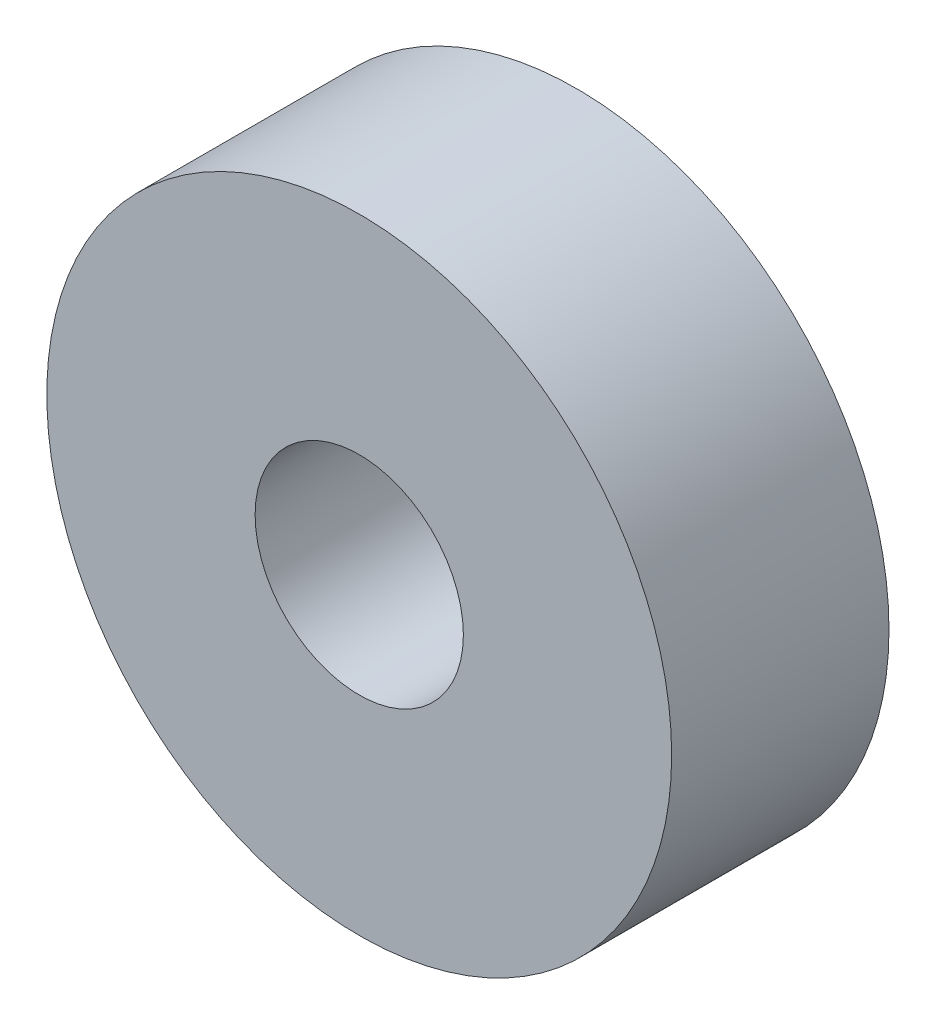
ISO-10303-21;
HEADER;
FILE_DESCRIPTION(('STEP AP214'),'2;1');
FILE_NAME('part.step','',(''),(''),'','','');
FILE_SCHEMA(('AUTOMOTIVE_DESIGN { 1 0 10303 214 1 1 1 1 }'));
ENDSEC;
DATA;
#1=APPLICATION_CONTEXT('core data for automotive mechanical design processes');
#2=APPLICATION_PROTOCOL_DEFINITION('international standard','automotive_design',2000,#1);
#3=PRODUCT_CONTEXT('',#1,'mechanical');
#4=PRODUCT('Part','Part','',(#3));
#5=PRODUCT_RELATED_PRODUCT_CATEGORY('part','',(#4));
#6=PRODUCT_DEFINITION_FORMATION('','',#4);
#7=PRODUCT_DEFINITION_CONTEXT('part definition',#1,'design');
#8=PRODUCT_DEFINITION('design','',#6,#7);
#9=PRODUCT_DEFINITION_SHAPE('','',#8);
#10=(LENGTH_UNIT() NAMED_UNIT(*) SI_UNIT(.MILLI.,.METRE.));
#11=(NAMED_UNIT(*) PLANE_ANGLE_UNIT() SI_UNIT($,.RADIAN.));
#12=(NAMED_UNIT(*) SI_UNIT($,.STERADIAN.) SOLID_ANGLE_UNIT());
#13=UNCERTAINTY_MEASURE_WITH_UNIT(LENGTH_MEASURE(1.E-05),#10,'distance_accuracy_value','');
#14=(GEOMETRIC_REPRESENTATION_CONTEXT(3) GLOBAL_UNCERTAINTY_ASSIGNED_CONTEXT((#13)) GLOBAL_UNIT_ASSIGNED_CONTEXT((#10,
#11,#12)) REPRESENTATION_CONTEXT('',''));
#15=CARTESIAN_POINT('',(0.,0.,0.));
#16=DIRECTION('',(0.,0.,1.));
#17=DIRECTION('',(1.,0.,0.));
#18=AXIS2_PLACEMENT_3D('',#15,#16,#17);
#19=CARTESIAN_POINT('',(0.,0.,3.048));
#20=DIRECTION('',(0.,0.,1.));
#21=DIRECTION('',(1.,0.,0.));
#22=AXIS2_PLACEMENT_3D('',#19,#20,#21);
#23=PLANE('',#22);
#24=CARTESIAN_POINT('',(0.,0.,3.048));
#25=DIRECTION('',(0.,0.,1.));
#26=DIRECTION('',(1.,0.,0.));
#27=AXIS2_PLACEMENT_3D('',#24,#25,#26);
#28=CIRCLE('',#27,4.3815);
#29=CARTESIAN_POINT('',(4.3815,0.,3.048));
#30=VERTEX_POINT('',#29);
#31=EDGE_CURVE('E10',#30,#30,#28,.T.);
#32=ORIENTED_EDGE('',*,*,#31,.T.);
#33=EDGE_LOOP('',(#32));
#34=FACE_BOUND('',#33,.T.);
#35=CARTESIAN_POINT('',(0.,0.,3.048));
#36=DIRECTION('',(0.,0.,1.));
#37=DIRECTION('',(1.,0.,0.));
#38=AXIS2_PLACEMENT_3D('',#35,#36,#37);
#39=CIRCLE('',#38,1.4605);
#40=CARTESIAN_POINT('',(1.4605,0.,3.048));
#41=VERTEX_POINT('',#40);
#42=EDGE_CURVE('E41',#41,#41,#39,.T.);
#43=ORIENTED_EDGE('',*,*,#42,.F.);
#44=EDGE_LOOP('',(#43));
#45=FACE_BOUND('',#44,.T.);
#46=ADVANCED_FACE('F30',(#34,#45),#23,.T.);
#47=CARTESIAN_POINT('',(0.,0.,0.));
#48=DIRECTION('',(0.,0.,1.));
#49=DIRECTION('',(1.,0.,0.));
#50=AXIS2_PLACEMENT_3D('',#47,#48,#49);
#51=PLANE('',#50);
#52=CARTESIAN_POINT('',(0.,0.,0.));
#53=DIRECTION('',(0.,0.,1.));
#54=DIRECTION('',(1.,0.,0.));
#55=AXIS2_PLACEMENT_3D('',#52,#53,#54);
#56=CIRCLE('',#55,4.3815);
#57=CARTESIAN_POINT('',(4.3815,0.,0.));
#58=VERTEX_POINT('',#57);
#59=EDGE_CURVE('E34',#58,#58,#56,.T.);
#60=ORIENTED_EDGE('',*,*,#59,.F.);
#61=EDGE_LOOP('',(#60));
#62=FACE_BOUND('',#61,.T.);
#63=CARTESIAN_POINT('',(0.,0.,0.));
#64=DIRECTION('',(0.,0.,1.));
#65=DIRECTION('',(1.,0.,0.));
#66=AXIS2_PLACEMENT_3D('',#63,#64,#65);
#67=CIRCLE('',#66,1.4605);
#68=CARTESIAN_POINT('',(1.4605,0.,0.));
#69=VERTEX_POINT('',#68);
#70=EDGE_CURVE('E43',#69,#69,#67,.T.);
#71=ORIENTED_EDGE('',*,*,#70,.T.);
#72=EDGE_LOOP('',(#71));
#73=FACE_BOUND('',#72,.T.);
#74=ADVANCED_FACE('F53',(#62,#73),#51,.F.);
#75=CARTESIAN_POINT('',(0.,0.,3.048));
#76=DIRECTION('',(0.,0.,-1.));
#77=DIRECTION('',(-1.,0.,0.));
#78=AXIS2_PLACEMENT_3D('',#75,#76,#77);
#79=CYLINDRICAL_SURFACE('',#78,4.3815);
#80=ORIENTED_EDGE('',*,*,#31,.F.);
#81=EDGE_LOOP('',(#80));
#82=FACE_BOUND('',#81,.T.);
#83=ORIENTED_EDGE('',*,*,#59,.T.);
#84=EDGE_LOOP('',(#83));
#85=FACE_BOUND('',#84,.T.);
#86=ADVANCED_FACE('F32',(#82,#85),#79,.T.);
#87=CARTESIAN_POINT('',(0.,0.,3.048));
#88=DIRECTION('',(0.,0.,-1.));
#89=DIRECTION('',(-1.,0.,0.));
#90=AXIS2_PLACEMENT_3D('',#87,#88,#89);
#91=CYLINDRICAL_SURFACE('',#90,1.4605);
#92=ORIENTED_EDGE('',*,*,#42,.T.);
#93=EDGE_LOOP('',(#92));
#94=FACE_BOUND('',#93,.T.);
#95=ORIENTED_EDGE('',*,*,#70,.F.);
#96=EDGE_LOOP('',(#95));
#97=FACE_BOUND('',#96,.T.);
#98=ADVANCED_FACE('F49',(#94,#97),#91,.F.);
#99=CLOSED_SHELL('',(#46,#74,#86,#98));
#100=MANIFOLD_SOLID_BREP('B2',#99);
#101=ADVANCED_BREP_SHAPE_REPRESENTATION('',(#18,#100),#14);
#102=SHAPE_DEFINITION_REPRESENTATION(#9,#101);
ENDSEC;
END-ISO-10303-21;
